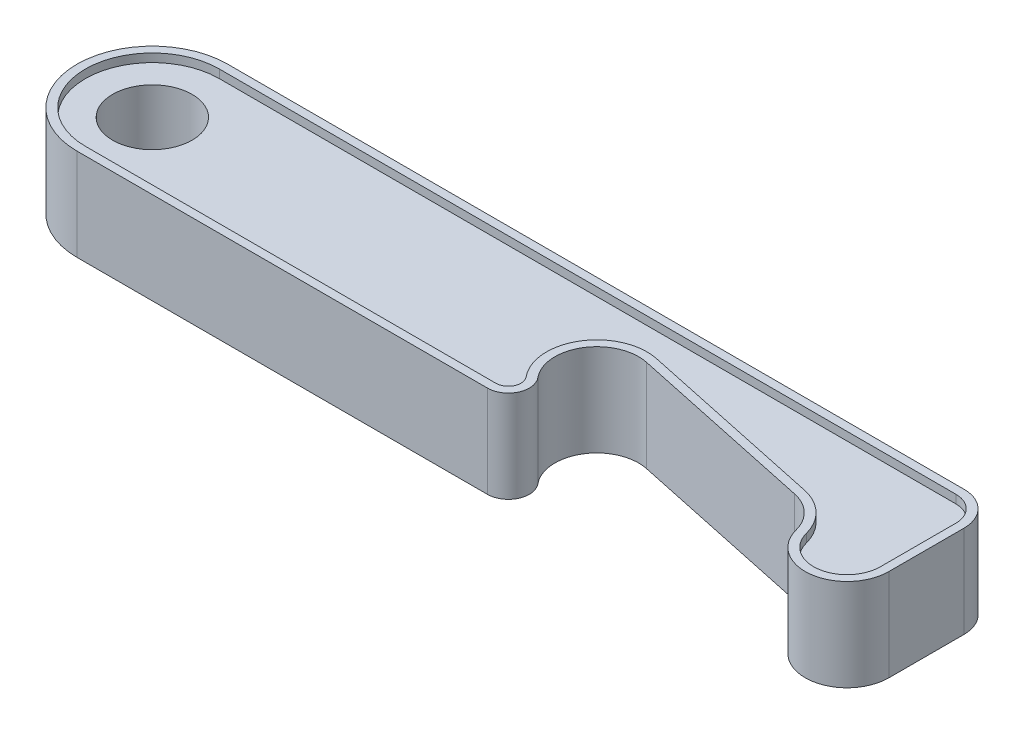
ISO-10303-21;
HEADER;
FILE_DESCRIPTION(('STEP AP214'),'2;1');
FILE_NAME('part.step','',(''),(''),'','','');
FILE_SCHEMA(('AUTOMOTIVE_DESIGN { 1 0 10303 214 1 1 1 1 }'));
ENDSEC;
DATA;
#1=APPLICATION_CONTEXT('core data for automotive mechanical design processes');
#2=APPLICATION_PROTOCOL_DEFINITION('international standard','automotive_design',2000,#1);
#3=PRODUCT_CONTEXT('',#1,'mechanical');
#4=PRODUCT('Part','Part','',(#3));
#5=PRODUCT_RELATED_PRODUCT_CATEGORY('part','',(#4));
#6=PRODUCT_DEFINITION_FORMATION('','',#4);
#7=PRODUCT_DEFINITION_CONTEXT('part definition',#1,'design');
#8=PRODUCT_DEFINITION('design','',#6,#7);
#9=PRODUCT_DEFINITION_SHAPE('','',#8);
#10=(LENGTH_UNIT() NAMED_UNIT(*) SI_UNIT(.MILLI.,.METRE.));
#11=(NAMED_UNIT(*) PLANE_ANGLE_UNIT() SI_UNIT($,.RADIAN.));
#12=(NAMED_UNIT(*) SI_UNIT($,.STERADIAN.) SOLID_ANGLE_UNIT());
#13=UNCERTAINTY_MEASURE_WITH_UNIT(LENGTH_MEASURE(1.E-05),#10,'distance_accuracy_value','');
#14=(GEOMETRIC_REPRESENTATION_CONTEXT(3) GLOBAL_UNCERTAINTY_ASSIGNED_CONTEXT((#13)) GLOBAL_UNIT_ASSIGNED_CONTEXT((#10,
#11,#12)) REPRESENTATION_CONTEXT('',''));
#15=CARTESIAN_POINT('',(0.,0.,0.));
#16=DIRECTION('',(0.,0.,1.));
#17=DIRECTION('',(1.,0.,0.));
#18=AXIS2_PLACEMENT_3D('',#15,#16,#17);
#19=CARTESIAN_POINT('',(0.,5.5,8.));
#20=DIRECTION('',(0.,0.,-1.));
#21=DIRECTION('',(-1.,0.,0.));
#22=AXIS2_PLACEMENT_3D('',#19,#20,#21);
#23=PLANE('',#22);
#24=DIRECTION('',(0.,-1.,0.));
#25=VECTOR('',#24,1.);
#26=CARTESIAN_POINT('',(0.,5.5,8.));
#27=LINE('',#26,#25);
#28=CARTESIAN_POINT('',(0.,-4.5,8.));
#29=VERTEX_POINT('',#28);
#30=CARTESIAN_POINT('',(0.,-5.5,8.));
#31=VERTEX_POINT('',#30);
#32=EDGE_CURVE('E48',#29,#31,#27,.T.);
#33=ORIENTED_EDGE('',*,*,#32,.F.);
#34=DIRECTION('',(1.,0.,0.));
#35=VECTOR('',#34,1.);
#36=CARTESIAN_POINT('',(0.,-4.5,8.));
#37=LINE('',#36,#35);
#38=CARTESIAN_POINT('',(49.0399082917025,-4.5,8.));
#39=VERTEX_POINT('',#38);
#40=EDGE_CURVE('E283',#29,#39,#37,.T.);
#41=ORIENTED_EDGE('',*,*,#40,.T.);
#42=DIRECTION('',(0.,-1.,0.));
#43=VECTOR('',#42,1.);
#44=CARTESIAN_POINT('',(49.0399082917025,5.5,8.));
#45=LINE('',#44,#43);
#46=CARTESIAN_POINT('',(49.0399082917025,-5.5,8.));
#47=VERTEX_POINT('',#46);
#48=EDGE_CURVE('E418',#39,#47,#45,.T.);
#49=ORIENTED_EDGE('',*,*,#48,.T.);
#50=DIRECTION('',(1.,0.,0.));
#51=VECTOR('',#50,1.);
#52=CARTESIAN_POINT('',(0.,-5.5,8.));
#53=LINE('',#52,#51);
#54=EDGE_CURVE('E388',#31,#47,#53,.T.);
#55=ORIENTED_EDGE('',*,*,#54,.F.);
#56=EDGE_LOOP('',(#33,#41,#49,#55));
#57=FACE_BOUND('',#56,.T.);
#58=ADVANCED_FACE('F39',(#57),#23,.T.);
#59=CARTESIAN_POINT('',(0.,5.5,0.));
#60=DIRECTION('',(0.,-1.,0.));
#61=DIRECTION('',(0.,0.,-1.));
#62=AXIS2_PLACEMENT_3D('',#59,#60,#61);
#63=CYLINDRICAL_SURFACE('',#62,8.);
#64=CARTESIAN_POINT('',(0.,-4.5,0.));
#65=DIRECTION('',(0.,1.,0.));
#66=DIRECTION('',(0.,0.,1.));
#67=AXIS2_PLACEMENT_3D('',#64,#65,#66);
#68=CIRCLE('',#67,8.);
#69=CARTESIAN_POINT('',(0.,-4.5,-8.));
#70=VERTEX_POINT('',#69);
#71=EDGE_CURVE('E281',#29,#70,#68,.F.);
#72=ORIENTED_EDGE('',*,*,#71,.F.);
#73=ORIENTED_EDGE('',*,*,#32,.T.);
#74=CARTESIAN_POINT('',(0.,-5.5,0.));
#75=DIRECTION('',(0.,1.,0.));
#76=DIRECTION('',(0.,0.,1.));
#77=AXIS2_PLACEMENT_3D('',#74,#75,#76);
#78=CIRCLE('',#77,8.);
#79=CARTESIAN_POINT('',(0.,-5.5,-8.));
#80=VERTEX_POINT('',#79);
#81=EDGE_CURVE('E391',#31,#80,#78,.F.);
#82=ORIENTED_EDGE('',*,*,#81,.T.);
#83=DIRECTION('',(0.,-1.,0.));
#84=VECTOR('',#83,1.);
#85=CARTESIAN_POINT('',(0.,5.5,-8.));
#86=LINE('',#85,#84);
#87=EDGE_CURVE('E441',#70,#80,#86,.T.);
#88=ORIENTED_EDGE('',*,*,#87,.F.);
#89=EDGE_LOOP('',(#72,#73,#82,#88));
#90=FACE_BOUND('',#89,.T.);
#91=ADVANCED_FACE('F512',(#90),#63,.F.);
#92=CARTESIAN_POINT('',(0.,5.5,-8.));
#93=DIRECTION('',(0.,0.,-1.));
#94=DIRECTION('',(-1.,0.,0.));
#95=AXIS2_PLACEMENT_3D('',#92,#93,#94);
#96=PLANE('',#95);
#97=DIRECTION('',(1.,0.,0.));
#98=VECTOR('',#97,1.);
#99=CARTESIAN_POINT('',(0.,-4.5,-8.));
#100=LINE('',#99,#98);
#101=CARTESIAN_POINT('',(87.9996910570678,-4.5,-8.));
#102=VERTEX_POINT('',#101);
#103=EDGE_CURVE('E302',#70,#102,#100,.T.);
#104=ORIENTED_EDGE('',*,*,#103,.F.);
#105=ORIENTED_EDGE('',*,*,#87,.T.);
#106=DIRECTION('',(1.,0.,0.));
#107=VECTOR('',#106,1.);
#108=CARTESIAN_POINT('',(0.,-5.5,-8.));
#109=LINE('',#108,#107);
#110=CARTESIAN_POINT('',(87.9996910570678,-5.5,-8.));
#111=VERTEX_POINT('',#110);
#112=EDGE_CURVE('E394',#80,#111,#109,.T.);
#113=ORIENTED_EDGE('',*,*,#112,.T.);
#114=DIRECTION('',(0.,-1.,0.));
#115=VECTOR('',#114,1.);
#116=CARTESIAN_POINT('',(87.9996910570678,5.5,-8.));
#117=LINE('',#116,#115);
#118=EDGE_CURVE('E437',#102,#111,#117,.T.);
#119=ORIENTED_EDGE('',*,*,#118,.F.);
#120=EDGE_LOOP('',(#104,#105,#113,#119));
#121=FACE_BOUND('',#120,.T.);
#122=ADVANCED_FACE('F508',(#121),#96,.F.);
#123=CARTESIAN_POINT('',(87.9996910570678,5.5,-5.));
#124=DIRECTION('',(0.,-1.,0.));
#125=DIRECTION('',(0.,0.,-1.));
#126=AXIS2_PLACEMENT_3D('',#123,#124,#125);
#127=CYLINDRICAL_SURFACE('',#126,3.00000000000001);
#128=DIRECTION('',(0.,-1.,0.));
#129=VECTOR('',#128,1.);
#130=CARTESIAN_POINT('',(90.9996910570678,5.5,-5.));
#131=LINE('',#130,#129);
#132=CARTESIAN_POINT('',(90.9996910570678,-4.5,-5.));
#133=VERTEX_POINT('',#132);
#134=CARTESIAN_POINT('',(90.9996910570678,-5.5,-5.));
#135=VERTEX_POINT('',#134);
#136=EDGE_CURVE('E433',#133,#135,#131,.T.);
#137=ORIENTED_EDGE('',*,*,#136,.F.);
#138=CARTESIAN_POINT('',(87.9996910570678,-4.5,-5.));
#139=DIRECTION('',(0.,1.,0.));
#140=DIRECTION('',(0.,0.,1.));
#141=AXIS2_PLACEMENT_3D('',#138,#139,#140);
#142=CIRCLE('',#141,3.00000000000001);
#143=EDGE_CURVE('E299',#133,#102,#142,.T.);
#144=ORIENTED_EDGE('',*,*,#143,.T.);
#145=ORIENTED_EDGE('',*,*,#118,.T.);
#146=CARTESIAN_POINT('',(87.9996910570678,-5.5,-5.));
#147=DIRECTION('',(0.,1.,0.));
#148=DIRECTION('',(0.,0.,1.));
#149=AXIS2_PLACEMENT_3D('',#146,#147,#148);
#150=CIRCLE('',#149,3.00000000000001);
#151=EDGE_CURVE('E397',#135,#111,#150,.T.);
#152=ORIENTED_EDGE('',*,*,#151,.F.);
#153=EDGE_LOOP('',(#137,#144,#145,#152));
#154=FACE_BOUND('',#153,.T.);
#155=ADVANCED_FACE('F504',(#154),#127,.F.);
#156=CARTESIAN_POINT('',(90.9996910570678,5.5,1.40319378118517E-13));
#157=DIRECTION('',(1.,0.,0.));
#158=DIRECTION('',(0.,0.,-1.));
#159=AXIS2_PLACEMENT_3D('',#156,#157,#158);
#160=PLANE('',#159);
#161=DIRECTION('',(0.,0.,1.));
#162=VECTOR('',#161,1.);
#163=CARTESIAN_POINT('',(90.9996910570678,-4.5,1.40319378118517E-13));
#164=LINE('',#163,#162);
#165=CARTESIAN_POINT('',(90.9996910570678,-4.5,4.));
#166=VERTEX_POINT('',#165);
#167=EDGE_CURVE('E297',#133,#166,#164,.T.);
#168=ORIENTED_EDGE('',*,*,#167,.F.);
#169=ORIENTED_EDGE('',*,*,#136,.T.);
#170=DIRECTION('',(0.,0.,1.));
#171=VECTOR('',#170,1.);
#172=CARTESIAN_POINT('',(90.9996910570678,-5.5,1.40319378118517E-13));
#173=LINE('',#172,#171);
#174=CARTESIAN_POINT('',(90.9996910570678,-5.5,4.));
#175=VERTEX_POINT('',#174);
#176=EDGE_CURVE('E400',#135,#175,#173,.T.);
#177=ORIENTED_EDGE('',*,*,#176,.T.);
#178=DIRECTION('',(0.,-1.,0.));
#179=VECTOR('',#178,1.);
#180=CARTESIAN_POINT('',(90.9996910570678,5.5,4.));
#181=LINE('',#180,#179);
#182=EDGE_CURVE('E429',#166,#175,#181,.T.);
#183=ORIENTED_EDGE('',*,*,#182,.F.);
#184=EDGE_LOOP('',(#168,#169,#177,#183));
#185=FACE_BOUND('',#184,.T.);
#186=ADVANCED_FACE('F500',(#185),#160,.F.);
#187=CARTESIAN_POINT('',(86.9996910570678,5.5,4.));
#188=DIRECTION('',(0.,-1.,0.));
#189=DIRECTION('',(0.,0.,-1.));
#190=AXIS2_PLACEMENT_3D('',#187,#188,#189);
#191=CYLINDRICAL_SURFACE('',#190,4.);
#192=CARTESIAN_POINT('',(86.9996910570678,-4.5,4.));
#193=DIRECTION('',(0.,1.,0.));
#194=DIRECTION('',(0.,0.,1.));
#195=AXIS2_PLACEMENT_3D('',#192,#193,#194);
#196=CIRCLE('',#195,4.);
#197=CARTESIAN_POINT('',(83.1267077108604,-4.5,5.00000000000013));
#198=VERTEX_POINT('',#197);
#199=EDGE_CURVE('E295',#166,#198,#196,.F.);
#200=ORIENTED_EDGE('',*,*,#199,.F.);
#201=ORIENTED_EDGE('',*,*,#182,.T.);
#202=CARTESIAN_POINT('',(86.9996910570678,-5.5,4.));
#203=DIRECTION('',(0.,1.,0.));
#204=DIRECTION('',(0.,0.,1.));
#205=AXIS2_PLACEMENT_3D('',#202,#203,#204);
#206=CIRCLE('',#205,4.);
#207=CARTESIAN_POINT('',(83.1267077108604,-5.5,5.00000000000013));
#208=VERTEX_POINT('',#207);
#209=EDGE_CURVE('E403',#175,#208,#206,.F.);
#210=ORIENTED_EDGE('',*,*,#209,.T.);
#211=DIRECTION('',(0.,-1.,0.));
#212=VECTOR('',#211,1.);
#213=CARTESIAN_POINT('',(83.1267077108604,5.5,5.00000000000013));
#214=LINE('',#213,#212);
#215=EDGE_CURVE('E425',#198,#208,#214,.T.);
#216=ORIENTED_EDGE('',*,*,#215,.F.);
#217=EDGE_LOOP('',(#200,#201,#210,#216));
#218=FACE_BOUND('',#217,.T.);
#219=ADVANCED_FACE('F496',(#218),#191,.F.);
#220=CARTESIAN_POINT('',(77.3172326915498,5.5,6.50000000000018));
#221=DIRECTION('',(0.,-1.,0.));
#222=DIRECTION('',(0.,0.,-1.));
#223=AXIS2_PLACEMENT_3D('',#220,#221,#222);
#224=CYLINDRICAL_SURFACE('',#223,5.99999999999948);
#225=CARTESIAN_POINT('',(77.3172326915498,-4.5,6.50000000000018));
#226=DIRECTION('',(0.,1.,0.));
#227=DIRECTION('',(0.,0.,1.));
#228=AXIS2_PLACEMENT_3D('',#225,#226,#227);
#229=CIRCLE('',#228,5.99999999999948);
#230=CARTESIAN_POINT('',(78.5647028364565,-4.5,0.631114395597909));
#231=VERTEX_POINT('',#230);
#232=EDGE_CURVE('E293',#198,#231,#229,.T.);
#233=ORIENTED_EDGE('',*,*,#232,.F.);
#234=ORIENTED_EDGE('',*,*,#215,.T.);
#235=CARTESIAN_POINT('',(77.3172326915498,-5.5,6.50000000000018));
#236=DIRECTION('',(0.,1.,0.));
#237=DIRECTION('',(0.,0.,1.));
#238=AXIS2_PLACEMENT_3D('',#235,#236,#237);
#239=CIRCLE('',#238,5.99999999999948);
#240=CARTESIAN_POINT('',(78.5647028364565,-5.5,0.631114395597909));
#241=VERTEX_POINT('',#240);
#242=EDGE_CURVE('E406',#208,#241,#239,.T.);
#243=ORIENTED_EDGE('',*,*,#242,.T.);
#244=DIRECTION('',(0.,-1.,0.));
#245=VECTOR('',#244,1.);
#246=CARTESIAN_POINT('',(78.5647028364565,5.5,0.631114395597909));
#247=LINE('',#246,#245);
#248=EDGE_CURVE('E421',#231,#241,#247,.T.);
#249=ORIENTED_EDGE('',*,*,#248,.F.);
#250=EDGE_LOOP('',(#233,#234,#243,#249));
#251=FACE_BOUND('',#250,.T.);
#252=ADVANCED_FACE('F490',(#251),#224,.T.);
#253=CARTESIAN_POINT('',(3.26778903925557,5.5,-15.3737387055024));
#254=DIRECTION('',(-0.207911690817799,0.,0.978147600733797));
#255=DIRECTION('',(0.978147600733797,0.,0.207911690817799));
#256=AXIS2_PLACEMENT_3D('',#253,#254,#255);
#257=PLANE('',#256);
#258=DIRECTION('',(-0.978147600733797,0.,-0.207911690817799));
#259=VECTOR('',#258,1.);
#260=CARTESIAN_POINT('',(3.26778903925557,-4.5,-15.3737387055024));
#261=LINE('',#260,#259);
#262=CARTESIAN_POINT('',(56.0647028364566,-4.5,-4.15140824197852));
#263=VERTEX_POINT('',#262);
#264=EDGE_CURVE('E291',#231,#263,#261,.T.);
#265=ORIENTED_EDGE('',*,*,#264,.F.);
#266=ORIENTED_EDGE('',*,*,#248,.T.);
#267=DIRECTION('',(-0.978147600733797,0.,-0.207911690817799));
#268=VECTOR('',#267,1.);
#269=CARTESIAN_POINT('',(3.26778903925557,-5.5,-15.3737387055024));
#270=LINE('',#269,#268);
#271=CARTESIAN_POINT('',(56.0647028364566,-5.5,-4.15140824197852));
#272=VERTEX_POINT('',#271);
#273=EDGE_CURVE('E409',#241,#272,#270,.T.);
#274=ORIENTED_EDGE('',*,*,#273,.T.);
#275=DIRECTION('',(0.,-1.,0.));
#276=VECTOR('',#275,1.);
#277=CARTESIAN_POINT('',(56.0647028364566,5.5,-4.15140824197852));
#278=LINE('',#277,#276);
#279=EDGE_CURVE('E247',#263,#272,#278,.T.);
#280=ORIENTED_EDGE('',*,*,#279,.F.);
#281=EDGE_LOOP('',(#265,#266,#274,#280));
#282=FACE_BOUND('',#281,.T.);
#283=ADVANCED_FACE('F486',(#282),#257,.F.);
#284=CARTESIAN_POINT('',(54.8172326915498,5.5,1.71747736242426));
#285=DIRECTION('',(0.,-1.,0.));
#286=DIRECTION('',(0.,0.,-1.));
#287=AXIS2_PLACEMENT_3D('',#284,#285,#286);
#288=CYLINDRICAL_SURFACE('',#287,5.99999999999999);
#289=CARTESIAN_POINT('',(54.8172326915498,-4.5,1.71747736242426));
#290=DIRECTION('',(0.,1.,0.));
#291=DIRECTION('',(0.,0.,1.));
#292=AXIS2_PLACEMENT_3D('',#289,#290,#291);
#293=CIRCLE('',#292,5.99999999999999);
#294=CARTESIAN_POINT('',(50.1953731716718,-4.5,5.54349547248508));
#295=VERTEX_POINT('',#294);
#296=EDGE_CURVE('E289',#263,#295,#293,.T.);
#297=ORIENTED_EDGE('',*,*,#296,.F.);
#298=ORIENTED_EDGE('',*,*,#279,.T.);
#299=CARTESIAN_POINT('',(54.8172326915498,-5.5,1.71747736242426));
#300=DIRECTION('',(0.,1.,0.));
#301=DIRECTION('',(0.,0.,1.));
#302=AXIS2_PLACEMENT_3D('',#299,#300,#301);
#303=CIRCLE('',#302,5.99999999999999);
#304=CARTESIAN_POINT('',(50.1953731716718,-5.5,5.54349547248508));
#305=VERTEX_POINT('',#304);
#306=EDGE_CURVE('E412',#272,#305,#303,.T.);
#307=ORIENTED_EDGE('',*,*,#306,.T.);
#308=DIRECTION('',(0.,-1.,0.));
#309=VECTOR('',#308,1.);
#310=CARTESIAN_POINT('',(50.1953731716718,5.5,5.54349547248508));
#311=LINE('',#310,#309);
#312=EDGE_CURVE('E248',#295,#305,#311,.T.);
#313=ORIENTED_EDGE('',*,*,#312,.F.);
#314=EDGE_LOOP('',(#297,#298,#307,#313));
#315=FACE_BOUND('',#314,.T.);
#316=ADVANCED_FACE('F480',(#315),#288,.T.);
#317=CARTESIAN_POINT('',(49.0399082917025,5.5,6.50000000000018));
#318=DIRECTION('',(0.,-1.,0.));
#319=DIRECTION('',(0.,0.,-1.));
#320=AXIS2_PLACEMENT_3D('',#317,#318,#319);
#321=CYLINDRICAL_SURFACE('',#320,1.49999999999982);
#322=ORIENTED_EDGE('',*,*,#48,.F.);
#323=CARTESIAN_POINT('',(49.0399082917025,-4.5,6.50000000000018));
#324=DIRECTION('',(0.,1.,0.));
#325=DIRECTION('',(0.,0.,1.));
#326=AXIS2_PLACEMENT_3D('',#323,#324,#325);
#327=CIRCLE('',#326,1.49999999999982);
#328=EDGE_CURVE('E286',#39,#295,#327,.T.);
#329=ORIENTED_EDGE('',*,*,#328,.T.);
#330=ORIENTED_EDGE('',*,*,#312,.T.);
#331=CARTESIAN_POINT('',(49.0399082917025,-5.5,6.50000000000018));
#332=DIRECTION('',(0.,1.,0.));
#333=DIRECTION('',(0.,0.,1.));
#334=AXIS2_PLACEMENT_3D('',#331,#332,#333);
#335=CIRCLE('',#334,1.49999999999982);
#336=EDGE_CURVE('E309',#47,#305,#335,.T.);
#337=ORIENTED_EDGE('',*,*,#336,.F.);
#338=EDGE_LOOP('',(#322,#329,#330,#337));
#339=FACE_BOUND('',#338,.T.);
#340=ADVANCED_FACE('F476',(#339),#321,.F.);
#341=DIRECTION('',(1.,0.,0.));
#342=VECTOR('',#341,1.);
#343=CARTESIAN_POINT('',(0.,4.5,8.));
#344=LINE('',#343,#342);
#345=CARTESIAN_POINT('',(0.,4.5,8.));
#346=VERTEX_POINT('',#345);
#347=CARTESIAN_POINT('',(49.0399082917025,4.5,8.));
#348=VERTEX_POINT('',#347);
#349=EDGE_CURVE('E56',#346,#348,#344,.T.);
#350=ORIENTED_EDGE('',*,*,#349,.F.);
#351=CARTESIAN_POINT('',(0.,5.5,8.));
#352=VERTEX_POINT('',#351);
#353=EDGE_CURVE('E11',#352,#346,#27,.T.);
#354=ORIENTED_EDGE('',*,*,#353,.F.);
#355=DIRECTION('',(1.,0.,0.));
#356=VECTOR('',#355,1.);
#357=CARTESIAN_POINT('',(0.,5.5,8.));
#358=LINE('',#357,#356);
#359=CARTESIAN_POINT('',(49.0399082917025,5.5,8.));
#360=VERTEX_POINT('',#359);
#361=EDGE_CURVE('E333',#352,#360,#358,.T.);
#362=ORIENTED_EDGE('',*,*,#361,.T.);
#363=EDGE_CURVE('E417',#360,#348,#45,.T.);
#364=ORIENTED_EDGE('',*,*,#363,.T.);
#365=EDGE_LOOP('',(#350,#354,#362,#364));
#366=FACE_BOUND('',#365,.T.);
#367=ADVANCED_FACE('F527',(#366),#23,.T.);
#368=ORIENTED_EDGE('',*,*,#353,.T.);
#369=CARTESIAN_POINT('',(0.,4.5,0.));
#370=DIRECTION('',(0.,1.,0.));
#371=DIRECTION('',(0.,0.,1.));
#372=AXIS2_PLACEMENT_3D('',#369,#370,#371);
#373=CIRCLE('',#372,8.);
#374=CARTESIAN_POINT('',(0.,4.5,-8.));
#375=VERTEX_POINT('',#374);
#376=EDGE_CURVE('E62',#346,#375,#373,.F.);
#377=ORIENTED_EDGE('',*,*,#376,.T.);
#378=CARTESIAN_POINT('',(0.,5.5,-8.));
#379=VERTEX_POINT('',#378);
#380=EDGE_CURVE('E442',#379,#375,#86,.T.);
#381=ORIENTED_EDGE('',*,*,#380,.F.);
#382=CARTESIAN_POINT('',(0.,5.5,0.));
#383=DIRECTION('',(0.,1.,0.));
#384=DIRECTION('',(0.,0.,1.));
#385=AXIS2_PLACEMENT_3D('',#382,#383,#384);
#386=CIRCLE('',#385,8.);
#387=EDGE_CURVE('E336',#352,#379,#386,.F.);
#388=ORIENTED_EDGE('',*,*,#387,.F.);
#389=EDGE_LOOP('',(#368,#377,#381,#388));
#390=FACE_BOUND('',#389,.T.);
#391=ADVANCED_FACE('F532',(#390),#63,.F.);
#392=ORIENTED_EDGE('',*,*,#380,.T.);
#393=DIRECTION('',(1.,0.,0.));
#394=VECTOR('',#393,1.);
#395=CARTESIAN_POINT('',(0.,4.5,-8.));
#396=LINE('',#395,#394);
#397=CARTESIAN_POINT('',(87.9996910570678,4.5,-8.));
#398=VERTEX_POINT('',#397);
#399=EDGE_CURVE('E275',#375,#398,#396,.T.);
#400=ORIENTED_EDGE('',*,*,#399,.T.);
#401=CARTESIAN_POINT('',(87.9996910570678,5.5,-8.));
#402=VERTEX_POINT('',#401);
#403=EDGE_CURVE('E438',#402,#398,#117,.T.);
#404=ORIENTED_EDGE('',*,*,#403,.F.);
#405=DIRECTION('',(1.,0.,0.));
#406=VECTOR('',#405,1.);
#407=CARTESIAN_POINT('',(0.,5.5,-8.));
#408=LINE('',#407,#406);
#409=EDGE_CURVE('E339',#379,#402,#408,.T.);
#410=ORIENTED_EDGE('',*,*,#409,.F.);
#411=EDGE_LOOP('',(#392,#400,#404,#410));
#412=FACE_BOUND('',#411,.T.);
#413=ADVANCED_FACE('F539',(#412),#96,.F.);
#414=CARTESIAN_POINT('',(87.9996910570678,4.5,-5.));
#415=DIRECTION('',(0.,1.,0.));
#416=DIRECTION('',(0.,0.,1.));
#417=AXIS2_PLACEMENT_3D('',#414,#415,#416);
#418=CIRCLE('',#417,3.00000000000001);
#419=CARTESIAN_POINT('',(90.9996910570678,4.5,-5.));
#420=VERTEX_POINT('',#419);
#421=EDGE_CURVE('E272',#420,#398,#418,.T.);
#422=ORIENTED_EDGE('',*,*,#421,.F.);
#423=CARTESIAN_POINT('',(90.9996910570678,5.5,-5.));
#424=VERTEX_POINT('',#423);
#425=EDGE_CURVE('E434',#424,#420,#131,.T.);
#426=ORIENTED_EDGE('',*,*,#425,.F.);
#427=CARTESIAN_POINT('',(87.9996910570678,5.5,-5.));
#428=DIRECTION('',(0.,1.,0.));
#429=DIRECTION('',(0.,0.,1.));
#430=AXIS2_PLACEMENT_3D('',#427,#428,#429);
#431=CIRCLE('',#430,3.00000000000001);
#432=EDGE_CURVE('E341',#424,#402,#431,.T.);
#433=ORIENTED_EDGE('',*,*,#432,.T.);
#434=ORIENTED_EDGE('',*,*,#403,.T.);
#435=EDGE_LOOP('',(#422,#426,#433,#434));
#436=FACE_BOUND('',#435,.T.);
#437=ADVANCED_FACE('F621',(#436),#127,.F.);
#438=ORIENTED_EDGE('',*,*,#425,.T.);
#439=DIRECTION('',(0.,0.,1.));
#440=VECTOR('',#439,1.);
#441=CARTESIAN_POINT('',(90.9996910570678,4.5,1.40319378118517E-13));
#442=LINE('',#441,#440);
#443=CARTESIAN_POINT('',(90.9996910570678,4.5,4.));
#444=VERTEX_POINT('',#443);
#445=EDGE_CURVE('E270',#420,#444,#442,.T.);
#446=ORIENTED_EDGE('',*,*,#445,.T.);
#447=CARTESIAN_POINT('',(90.9996910570678,5.5,4.));
#448=VERTEX_POINT('',#447);
#449=EDGE_CURVE('E430',#448,#444,#181,.T.);
#450=ORIENTED_EDGE('',*,*,#449,.F.);
#451=DIRECTION('',(0.,0.,1.));
#452=VECTOR('',#451,1.);
#453=CARTESIAN_POINT('',(90.9996910570678,5.5,1.40319378118517E-13));
#454=LINE('',#453,#452);
#455=EDGE_CURVE('E344',#424,#448,#454,.T.);
#456=ORIENTED_EDGE('',*,*,#455,.F.);
#457=EDGE_LOOP('',(#438,#446,#450,#456));
#458=FACE_BOUND('',#457,.T.);
#459=ADVANCED_FACE('F624',(#458),#160,.F.);
#460=ORIENTED_EDGE('',*,*,#449,.T.);
#461=CARTESIAN_POINT('',(86.9996910570678,4.5,4.));
#462=DIRECTION('',(0.,1.,0.));
#463=DIRECTION('',(0.,0.,1.));
#464=AXIS2_PLACEMENT_3D('',#461,#462,#463);
#465=CIRCLE('',#464,4.);
#466=CARTESIAN_POINT('',(83.1267077108604,4.5,5.00000000000013));
#467=VERTEX_POINT('',#466);
#468=EDGE_CURVE('E268',#444,#467,#465,.F.);
#469=ORIENTED_EDGE('',*,*,#468,.T.);
#470=CARTESIAN_POINT('',(83.1267077108604,5.5,5.00000000000013));
#471=VERTEX_POINT('',#470);
#472=EDGE_CURVE('E426',#471,#467,#214,.T.);
#473=ORIENTED_EDGE('',*,*,#472,.F.);
#474=CARTESIAN_POINT('',(86.9996910570678,5.5,4.));
#475=DIRECTION('',(0.,1.,0.));
#476=DIRECTION('',(0.,0.,1.));
#477=AXIS2_PLACEMENT_3D('',#474,#475,#476);
#478=CIRCLE('',#477,4.);
#479=EDGE_CURVE('E347',#448,#471,#478,.F.);
#480=ORIENTED_EDGE('',*,*,#479,.F.);
#481=EDGE_LOOP('',(#460,#469,#473,#480));
#482=FACE_BOUND('',#481,.T.);
#483=ADVANCED_FACE('F630',(#482),#191,.F.);
#484=ORIENTED_EDGE('',*,*,#472,.T.);
#485=CARTESIAN_POINT('',(77.3172326915498,4.5,6.50000000000018));
#486=DIRECTION('',(0.,1.,0.));
#487=DIRECTION('',(0.,0.,1.));
#488=AXIS2_PLACEMENT_3D('',#485,#486,#487);
#489=CIRCLE('',#488,5.99999999999948);
#490=CARTESIAN_POINT('',(78.5647028364565,4.5,0.631114395597909));
#491=VERTEX_POINT('',#490);
#492=EDGE_CURVE('E266',#467,#491,#489,.T.);
#493=ORIENTED_EDGE('',*,*,#492,.T.);
#494=CARTESIAN_POINT('',(78.5647028364565,5.5,0.631114395597909));
#495=VERTEX_POINT('',#494);
#496=EDGE_CURVE('E422',#495,#491,#247,.T.);
#497=ORIENTED_EDGE('',*,*,#496,.F.);
#498=CARTESIAN_POINT('',(77.3172326915498,5.5,6.50000000000018));
#499=DIRECTION('',(0.,1.,0.));
#500=DIRECTION('',(0.,0.,1.));
#501=AXIS2_PLACEMENT_3D('',#498,#499,#500);
#502=CIRCLE('',#501,5.99999999999948);
#503=EDGE_CURVE('E350',#471,#495,#502,.T.);
#504=ORIENTED_EDGE('',*,*,#503,.F.);
#505=EDGE_LOOP('',(#484,#493,#497,#504));
#506=FACE_BOUND('',#505,.T.);
#507=ADVANCED_FACE('F633',(#506),#224,.T.);
#508=ORIENTED_EDGE('',*,*,#496,.T.);
#509=DIRECTION('',(-0.978147600733797,0.,-0.207911690817799));
#510=VECTOR('',#509,1.);
#511=CARTESIAN_POINT('',(3.26778903925557,4.5,-15.3737387055024));
#512=LINE('',#511,#510);
#513=CARTESIAN_POINT('',(56.0647028364566,4.5,-4.15140824197852));
#514=VERTEX_POINT('',#513);
#515=EDGE_CURVE('E258',#491,#514,#512,.T.);
#516=ORIENTED_EDGE('',*,*,#515,.T.);
#517=CARTESIAN_POINT('',(56.0647028364566,5.5,-4.15140824197852));
#518=VERTEX_POINT('',#517);
#519=EDGE_CURVE('E255',#518,#514,#278,.T.);
#520=ORIENTED_EDGE('',*,*,#519,.F.);
#521=DIRECTION('',(-0.978147600733797,0.,-0.207911690817799));
#522=VECTOR('',#521,1.);
#523=CARTESIAN_POINT('',(3.26778903925557,5.5,-15.3737387055024));
#524=LINE('',#523,#522);
#525=EDGE_CURVE('E353',#495,#518,#524,.T.);
#526=ORIENTED_EDGE('',*,*,#525,.F.);
#527=EDGE_LOOP('',(#508,#516,#520,#526));
#528=FACE_BOUND('',#527,.T.);
#529=ADVANCED_FACE('F635',(#528),#257,.F.);
#530=ORIENTED_EDGE('',*,*,#519,.T.);
#531=CARTESIAN_POINT('',(54.8172326915498,4.5,1.71747736242426));
#532=DIRECTION('',(0.,1.,0.));
#533=DIRECTION('',(0.,0.,1.));
#534=AXIS2_PLACEMENT_3D('',#531,#532,#533);
#535=CIRCLE('',#534,5.99999999999999);
#536=CARTESIAN_POINT('',(50.1953731716718,4.5,5.54349547248508));
#537=VERTEX_POINT('',#536);
#538=EDGE_CURVE('E252',#514,#537,#535,.T.);
#539=ORIENTED_EDGE('',*,*,#538,.T.);
#540=CARTESIAN_POINT('',(50.1953731716718,5.5,5.54349547248508));
#541=VERTEX_POINT('',#540);
#542=EDGE_CURVE('E239',#541,#537,#311,.T.);
#543=ORIENTED_EDGE('',*,*,#542,.F.);
#544=CARTESIAN_POINT('',(54.8172326915498,5.5,1.71747736242426));
#545=DIRECTION('',(0.,1.,0.));
#546=DIRECTION('',(0.,0.,1.));
#547=AXIS2_PLACEMENT_3D('',#544,#545,#546);
#548=CIRCLE('',#547,5.99999999999999);
#549=EDGE_CURVE('E356',#518,#541,#548,.T.);
#550=ORIENTED_EDGE('',*,*,#549,.F.);
#551=EDGE_LOOP('',(#530,#539,#543,#550));
#552=FACE_BOUND('',#551,.T.);
#553=ADVANCED_FACE('F253',(#552),#288,.T.);
#554=CARTESIAN_POINT('',(77.3172326915498,5.5,6.50000000000018));
#555=DIRECTION('',(0.,-1.,0.));
#556=DIRECTION('',(0.,0.,-1.));
#557=AXIS2_PLACEMENT_3D('',#554,#555,#556);
#558=CYLINDRICAL_SURFACE('',#557,4.99999999999948);
#559=CARTESIAN_POINT('',(77.3172326915498,-5.5,6.50000000000018));
#560=DIRECTION('',(0.,1.,0.));
#561=DIRECTION('',(0.,0.,1.));
#562=AXIS2_PLACEMENT_3D('',#559,#560,#561);
#563=CIRCLE('',#562,4.99999999999948);
#564=CARTESIAN_POINT('',(82.1584618743085,-5.5,5.25000000000016));
#565=VERTEX_POINT('',#564);
#566=CARTESIAN_POINT('',(78.3567911456387,-5.5,1.60926199633171));
#567=VERTEX_POINT('',#566);
#568=EDGE_CURVE('E277',#565,#567,#563,.T.);
#569=ORIENTED_EDGE('',*,*,#568,.F.);
#570=DIRECTION('',(0.,-1.,0.));
#571=VECTOR('',#570,1.);
#572=CARTESIAN_POINT('',(82.1584618743085,5.5,5.25000000000016));
#573=LINE('',#572,#571);
#574=CARTESIAN_POINT('',(82.1584618743085,5.5,5.25000000000016));
#575=VERTEX_POINT('',#574);
#576=EDGE_CURVE('E43',#575,#565,#573,.T.);
#577=ORIENTED_EDGE('',*,*,#576,.F.);
#578=CARTESIAN_POINT('',(77.3172326915498,5.5,6.50000000000018));
#579=DIRECTION('',(0.,1.,0.));
#580=DIRECTION('',(0.,0.,1.));
#581=AXIS2_PLACEMENT_3D('',#578,#579,#580);
#582=CIRCLE('',#581,4.99999999999948);
#583=CARTESIAN_POINT('',(78.3567911456387,5.5,1.60926199633171));
#584=VERTEX_POINT('',#583);
#585=EDGE_CURVE('E305',#575,#584,#582,.T.);
#586=ORIENTED_EDGE('',*,*,#585,.T.);
#587=DIRECTION('',(0.,-1.,0.));
#588=VECTOR('',#587,1.);
#589=CARTESIAN_POINT('',(78.3567911456387,5.5,1.60926199633171));
#590=LINE('',#589,#588);
#591=EDGE_CURVE('E359',#584,#567,#590,.T.);
#592=ORIENTED_EDGE('',*,*,#591,.T.);
#593=EDGE_LOOP('',(#569,#577,#586,#592));
#594=FACE_BOUND('',#593,.T.);
#595=ADVANCED_FACE('F41',(#594),#558,.F.);
#596=CARTESIAN_POINT('',(86.9996910570678,5.5,4.));
#597=DIRECTION('',(0.,-1.,0.));
#598=DIRECTION('',(0.,0.,-1.));
#599=AXIS2_PLACEMENT_3D('',#596,#597,#598);
#600=CYLINDRICAL_SURFACE('',#599,5.00000000000001);
#601=CARTESIAN_POINT('',(86.9996910570678,-5.5,4.));
#602=DIRECTION('',(0.,1.,0.));
#603=DIRECTION('',(0.,0.,1.));
#604=AXIS2_PLACEMENT_3D('',#601,#602,#603);
#605=CIRCLE('',#604,5.00000000000001);
#606=CARTESIAN_POINT('',(91.9996910570678,-5.5,4.));
#607=VERTEX_POINT('',#606);
#608=EDGE_CURVE('E362',#607,#565,#605,.F.);
#609=ORIENTED_EDGE('',*,*,#608,.F.);
#610=DIRECTION('',(0.,-1.,0.));
#611=VECTOR('',#610,1.);
#612=CARTESIAN_POINT('',(91.9996910570678,5.5,4.));
#613=LINE('',#612,#611);
#614=CARTESIAN_POINT('',(91.9996910570678,5.5,4.));
#615=VERTEX_POINT('',#614);
#616=EDGE_CURVE('E459',#615,#607,#613,.T.);
#617=ORIENTED_EDGE('',*,*,#616,.F.);
#618=CARTESIAN_POINT('',(86.9996910570678,5.5,4.));
#619=DIRECTION('',(0.,1.,0.));
#620=DIRECTION('',(0.,0.,1.));
#621=AXIS2_PLACEMENT_3D('',#618,#619,#620);
#622=CIRCLE('',#621,5.00000000000001);
#623=EDGE_CURVE('E308',#615,#575,#622,.F.);
#624=ORIENTED_EDGE('',*,*,#623,.T.);
#625=ORIENTED_EDGE('',*,*,#576,.T.);
#626=EDGE_LOOP('',(#609,#617,#624,#625));
#627=FACE_BOUND('',#626,.T.);
#628=ADVANCED_FACE('F586',(#627),#600,.T.);
#629=CARTESIAN_POINT('',(91.9996910570678,5.5,-1.41861354541608E-13));
#630=DIRECTION('',(1.,0.,0.));
#631=DIRECTION('',(0.,0.,-1.));
#632=AXIS2_PLACEMENT_3D('',#629,#630,#631);
#633=PLANE('',#632);
#634=DIRECTION('',(0.,0.,1.));
#635=VECTOR('',#634,1.);
#636=CARTESIAN_POINT('',(91.9996910570678,-5.5,-1.41861354541608E-13));
#637=LINE('',#636,#635);
#638=CARTESIAN_POINT('',(91.9996910570678,-5.5,-5.));
#639=VERTEX_POINT('',#638);
#640=EDGE_CURVE('E365',#639,#607,#637,.T.);
#641=ORIENTED_EDGE('',*,*,#640,.F.);
#642=DIRECTION('',(0.,-1.,0.));
#643=VECTOR('',#642,1.);
#644=CARTESIAN_POINT('',(91.9996910570678,5.5,-5.));
#645=LINE('',#644,#643);
#646=CARTESIAN_POINT('',(91.9996910570678,5.5,-5.));
#647=VERTEX_POINT('',#646);
#648=EDGE_CURVE('E458',#647,#639,#645,.T.);
#649=ORIENTED_EDGE('',*,*,#648,.F.);
#650=DIRECTION('',(0.,0.,1.));
#651=VECTOR('',#650,1.);
#652=CARTESIAN_POINT('',(91.9996910570678,5.5,-1.41861354541608E-13));
#653=LINE('',#652,#651);
#654=EDGE_CURVE('E312',#647,#615,#653,.T.);
#655=ORIENTED_EDGE('',*,*,#654,.T.);
#656=ORIENTED_EDGE('',*,*,#616,.T.);
#657=EDGE_LOOP('',(#641,#649,#655,#656));
#658=FACE_BOUND('',#657,.T.);
#659=ADVANCED_FACE('F583',(#658),#633,.T.);
#660=CARTESIAN_POINT('',(87.9996910570678,5.5,-5.));
#661=DIRECTION('',(0.,-1.,0.));
#662=DIRECTION('',(0.,0.,-1.));
#663=AXIS2_PLACEMENT_3D('',#660,#661,#662);
#664=CYLINDRICAL_SURFACE('',#663,4.);
#665=CARTESIAN_POINT('',(87.9996910570678,-5.5,-5.));
#666=DIRECTION('',(0.,1.,0.));
#667=DIRECTION('',(0.,0.,1.));
#668=AXIS2_PLACEMENT_3D('',#665,#666,#667);
#669=CIRCLE('',#668,4.);
#670=CARTESIAN_POINT('',(87.9996910570678,-5.5,-9.));
#671=VERTEX_POINT('',#670);
#672=EDGE_CURVE('E368',#639,#671,#669,.T.);
#673=ORIENTED_EDGE('',*,*,#672,.T.);
#674=DIRECTION('',(0.,-1.,0.));
#675=VECTOR('',#674,1.);
#676=CARTESIAN_POINT('',(87.9996910570678,5.5,-9.));
#677=LINE('',#676,#675);
#678=CARTESIAN_POINT('',(87.9996910570678,5.5,-9.));
#679=VERTEX_POINT('',#678);
#680=EDGE_CURVE('E456',#679,#671,#677,.T.);
#681=ORIENTED_EDGE('',*,*,#680,.F.);
#682=CARTESIAN_POINT('',(87.9996910570678,5.5,-5.));
#683=DIRECTION('',(0.,1.,0.));
#684=DIRECTION('',(0.,0.,1.));
#685=AXIS2_PLACEMENT_3D('',#682,#683,#684);
#686=CIRCLE('',#685,4.);
#687=EDGE_CURVE('E315',#647,#679,#686,.T.);
#688=ORIENTED_EDGE('',*,*,#687,.F.);
#689=ORIENTED_EDGE('',*,*,#648,.T.);
#690=EDGE_LOOP('',(#673,#681,#688,#689));
#691=FACE_BOUND('',#690,.T.);
#692=ADVANCED_FACE('F579',(#691),#664,.T.);
#693=CARTESIAN_POINT('',(0.,5.5,-9.));
#694=DIRECTION('',(0.,0.,-1.));
#695=DIRECTION('',(-1.,0.,0.));
#696=AXIS2_PLACEMENT_3D('',#693,#694,#695);
#697=PLANE('',#696);
#698=DIRECTION('',(1.,0.,0.));
#699=VECTOR('',#698,1.);
#700=CARTESIAN_POINT('',(0.,-5.5,-9.));
#701=LINE('',#700,#699);
#702=CARTESIAN_POINT('',(0.,-5.5,-9.));
#703=VERTEX_POINT('',#702);
#704=EDGE_CURVE('E371',#703,#671,#701,.T.);
#705=ORIENTED_EDGE('',*,*,#704,.F.);
#706=DIRECTION('',(0.,-1.,0.));
#707=VECTOR('',#706,1.);
#708=CARTESIAN_POINT('',(0.,5.5,-9.));
#709=LINE('',#708,#707);
#710=CARTESIAN_POINT('',(0.,5.5,-9.));
#711=VERTEX_POINT('',#710);
#712=EDGE_CURVE('E454',#711,#703,#709,.T.);
#713=ORIENTED_EDGE('',*,*,#712,.F.);
#714=DIRECTION('',(1.,0.,0.));
#715=VECTOR('',#714,1.);
#716=CARTESIAN_POINT('',(0.,5.5,-9.));
#717=LINE('',#716,#715);
#718=EDGE_CURVE('E317',#711,#679,#717,.T.);
#719=ORIENTED_EDGE('',*,*,#718,.T.);
#720=ORIENTED_EDGE('',*,*,#680,.T.);
#721=EDGE_LOOP('',(#705,#713,#719,#720));
#722=FACE_BOUND('',#721,.T.);
#723=ADVANCED_FACE('F575',(#722),#697,.T.);
#724=CARTESIAN_POINT('',(0.,5.5,0.));
#725=DIRECTION('',(0.,-1.,0.));
#726=DIRECTION('',(0.,0.,-1.));
#727=AXIS2_PLACEMENT_3D('',#724,#725,#726);
#728=CYLINDRICAL_SURFACE('',#727,9.);
#729=CARTESIAN_POINT('',(0.,-5.5,0.));
#730=DIRECTION('',(0.,1.,0.));
#731=DIRECTION('',(0.,0.,1.));
#732=AXIS2_PLACEMENT_3D('',#729,#730,#731);
#733=CIRCLE('',#732,9.);
#734=CARTESIAN_POINT('',(0.,-5.5,9.));
#735=VERTEX_POINT('',#734);
#736=EDGE_CURVE('E374',#735,#703,#733,.F.);
#737=ORIENTED_EDGE('',*,*,#736,.F.);
#738=DIRECTION('',(0.,-1.,0.));
#739=VECTOR('',#738,1.);
#740=CARTESIAN_POINT('',(0.,5.5,9.));
#741=LINE('',#740,#739);
#742=CARTESIAN_POINT('',(0.,5.5,9.));
#743=VERTEX_POINT('',#742);
#744=EDGE_CURVE('E452',#743,#735,#741,.T.);
#745=ORIENTED_EDGE('',*,*,#744,.F.);
#746=CARTESIAN_POINT('',(0.,5.5,0.));
#747=DIRECTION('',(0.,1.,0.));
#748=DIRECTION('',(0.,0.,1.));
#749=AXIS2_PLACEMENT_3D('',#746,#747,#748);
#750=CIRCLE('',#749,9.);
#751=EDGE_CURVE('E320',#743,#711,#750,.F.);
#752=ORIENTED_EDGE('',*,*,#751,.T.);
#753=ORIENTED_EDGE('',*,*,#712,.T.);
#754=EDGE_LOOP('',(#737,#745,#752,#753));
#755=FACE_BOUND('',#754,.T.);
#756=ADVANCED_FACE('F571',(#755),#728,.T.);
#757=CARTESIAN_POINT('',(0.,5.5,9.));
#758=DIRECTION('',(0.,0.,-1.));
#759=DIRECTION('',(-1.,0.,0.));
#760=AXIS2_PLACEMENT_3D('',#757,#758,#759);
#761=PLANE('',#760);
#762=DIRECTION('',(1.,0.,0.));
#763=VECTOR('',#762,1.);
#764=CARTESIAN_POINT('',(0.,-5.5,9.));
#765=LINE('',#764,#763);
#766=CARTESIAN_POINT('',(49.0399082917025,-5.5,9.));
#767=VERTEX_POINT('',#766);
#768=EDGE_CURVE('E377',#735,#767,#765,.T.);
#769=ORIENTED_EDGE('',*,*,#768,.T.);
#770=DIRECTION('',(0.,-1.,0.));
#771=VECTOR('',#770,1.);
#772=CARTESIAN_POINT('',(49.0399082917025,5.5,9.));
#773=LINE('',#772,#771);
#774=CARTESIAN_POINT('',(49.0399082917025,5.5,9.));
#775=VERTEX_POINT('',#774);
#776=EDGE_CURVE('E449',#775,#767,#773,.T.);
#777=ORIENTED_EDGE('',*,*,#776,.F.);
#778=DIRECTION('',(1.,0.,0.));
#779=VECTOR('',#778,1.);
#780=CARTESIAN_POINT('',(0.,5.5,9.));
#781=LINE('',#780,#779);
#782=EDGE_CURVE('E323',#743,#775,#781,.T.);
#783=ORIENTED_EDGE('',*,*,#782,.F.);
#784=ORIENTED_EDGE('',*,*,#744,.T.);
#785=EDGE_LOOP('',(#769,#777,#783,#784));
#786=FACE_BOUND('',#785,.T.);
#787=ADVANCED_FACE('F567',(#786),#761,.F.);
#788=CARTESIAN_POINT('',(49.0399082917025,5.5,6.50000000000018));
#789=DIRECTION('',(0.,-1.,0.));
#790=DIRECTION('',(0.,0.,-1.));
#791=AXIS2_PLACEMENT_3D('',#788,#789,#790);
#792=CYLINDRICAL_SURFACE('',#791,2.49999999999982);
#793=CARTESIAN_POINT('',(49.0399082917025,-5.5,6.50000000000018));
#794=DIRECTION('',(0.,1.,0.));
#795=DIRECTION('',(0.,0.,1.));
#796=AXIS2_PLACEMENT_3D('',#793,#794,#795);
#797=CIRCLE('',#796,2.49999999999982);
#798=CARTESIAN_POINT('',(50.9656830916515,-5.5,4.90582578747496));
#799=VERTEX_POINT('',#798);
#800=EDGE_CURVE('E379',#767,#799,#797,.T.);
#801=ORIENTED_EDGE('',*,*,#800,.T.);
#802=DIRECTION('',(0.,-1.,0.));
#803=VECTOR('',#802,1.);
#804=CARTESIAN_POINT('',(50.9656830916515,5.5,4.90582578747496));
#805=LINE('',#804,#803);
#806=CARTESIAN_POINT('',(50.9656830916515,5.5,4.90582578747496));
#807=VERTEX_POINT('',#806);
#808=EDGE_CURVE('E447',#807,#799,#805,.T.);
#809=ORIENTED_EDGE('',*,*,#808,.F.);
#810=CARTESIAN_POINT('',(49.0399082917025,5.5,6.50000000000018));
#811=DIRECTION('',(0.,1.,0.));
#812=DIRECTION('',(0.,0.,1.));
#813=AXIS2_PLACEMENT_3D('',#810,#811,#812);
#814=CIRCLE('',#813,2.49999999999982);
#815=EDGE_CURVE('E325',#775,#807,#814,.T.);
#816=ORIENTED_EDGE('',*,*,#815,.F.);
#817=ORIENTED_EDGE('',*,*,#776,.T.);
#818=EDGE_LOOP('',(#801,#809,#816,#817));
#819=FACE_BOUND('',#818,.T.);
#820=ADVANCED_FACE('F560',(#819),#792,.T.);
#821=CARTESIAN_POINT('',(54.8172326915498,5.5,1.71747736242426));
#822=DIRECTION('',(0.,-1.,0.));
#823=DIRECTION('',(0.,0.,-1.));
#824=AXIS2_PLACEMENT_3D('',#821,#822,#823);
#825=CYLINDRICAL_SURFACE('',#824,5.);
#826=CARTESIAN_POINT('',(54.8172326915498,-5.5,1.71747736242426));
#827=DIRECTION('',(0.,1.,0.));
#828=DIRECTION('',(0.,0.,1.));
#829=AXIS2_PLACEMENT_3D('',#826,#827,#828);
#830=CIRCLE('',#829,5.);
#831=CARTESIAN_POINT('',(55.8567911456388,-5.5,-3.17326064124473));
#832=VERTEX_POINT('',#831);
#833=EDGE_CURVE('E382',#832,#799,#830,.T.);
#834=ORIENTED_EDGE('',*,*,#833,.F.);
#835=DIRECTION('',(0.,-1.,0.));
#836=VECTOR('',#835,1.);
#837=CARTESIAN_POINT('',(55.8567911456388,5.5,-3.17326064124473));
#838=LINE('',#837,#836);
#839=CARTESIAN_POINT('',(55.8567911456388,5.5,-3.17326064124473));
#840=VERTEX_POINT('',#839);
#841=EDGE_CURVE('E445',#840,#832,#838,.T.);
#842=ORIENTED_EDGE('',*,*,#841,.F.);
#843=CARTESIAN_POINT('',(54.8172326915498,5.5,1.71747736242426));
#844=DIRECTION('',(0.,1.,0.));
#845=DIRECTION('',(0.,0.,1.));
#846=AXIS2_PLACEMENT_3D('',#843,#844,#845);
#847=CIRCLE('',#846,5.);
#848=EDGE_CURVE('E327',#840,#807,#847,.T.);
#849=ORIENTED_EDGE('',*,*,#848,.T.);
#850=ORIENTED_EDGE('',*,*,#808,.T.);
#851=EDGE_LOOP('',(#834,#842,#849,#850));
#852=FACE_BOUND('',#851,.T.);
#853=ADVANCED_FACE('F555',(#852),#825,.F.);
#854=CARTESIAN_POINT('',(3.05987734843779,5.5,-14.3955911047686));
#855=DIRECTION('',(-0.2079116908178,0.,0.978147600733797));
#856=DIRECTION('',(0.978147600733797,0.,0.2079116908178));
#857=AXIS2_PLACEMENT_3D('',#854,#855,#856);
#858=PLANE('',#857);
#859=DIRECTION('',(-0.978147600733797,0.,-0.2079116908178));
#860=VECTOR('',#859,1.);
#861=CARTESIAN_POINT('',(3.05987734843779,-5.5,-14.3955911047686));
#862=LINE('',#861,#860);
#863=EDGE_CURVE('E385',#567,#832,#862,.T.);
#864=ORIENTED_EDGE('',*,*,#863,.F.);
#865=ORIENTED_EDGE('',*,*,#591,.F.);
#866=DIRECTION('',(-0.978147600733797,0.,-0.2079116908178));
#867=VECTOR('',#866,1.);
#868=CARTESIAN_POINT('',(3.05987734843779,5.5,-14.3955911047686));
#869=LINE('',#868,#867);
#870=EDGE_CURVE('E330',#584,#840,#869,.T.);
#871=ORIENTED_EDGE('',*,*,#870,.T.);
#872=ORIENTED_EDGE('',*,*,#841,.T.);
#873=EDGE_LOOP('',(#864,#865,#871,#872));
#874=FACE_BOUND('',#873,.T.);
#875=ADVANCED_FACE('F548',(#874),#858,.T.);
#876=CARTESIAN_POINT('',(49.0399082917025,4.5,6.50000000000018));
#877=DIRECTION('',(0.,1.,0.));
#878=DIRECTION('',(0.,0.,1.));
#879=AXIS2_PLACEMENT_3D('',#876,#877,#878);
#880=CIRCLE('',#879,1.49999999999982);
#881=EDGE_CURVE('E243',#348,#537,#880,.T.);
#882=ORIENTED_EDGE('',*,*,#881,.F.);
#883=ORIENTED_EDGE('',*,*,#363,.F.);
#884=CARTESIAN_POINT('',(49.0399082917025,5.5,6.50000000000018));
#885=DIRECTION('',(0.,1.,0.));
#886=DIRECTION('',(0.,0.,1.));
#887=AXIS2_PLACEMENT_3D('',#884,#885,#886);
#888=CIRCLE('',#887,1.49999999999982);
#889=EDGE_CURVE('E245',#360,#541,#888,.T.);
#890=ORIENTED_EDGE('',*,*,#889,.T.);
#891=ORIENTED_EDGE('',*,*,#542,.T.);
#892=EDGE_LOOP('',(#882,#883,#890,#891));
#893=FACE_BOUND('',#892,.T.);
#894=ADVANCED_FACE('F241',(#893),#321,.F.);
#895=CARTESIAN_POINT('',(0.,5.5,0.));
#896=DIRECTION('',(0.,1.,0.));
#897=DIRECTION('',(0.,0.,1.));
#898=AXIS2_PLACEMENT_3D('',#895,#896,#897);
#899=PLANE('',#898);
#900=ORIENTED_EDGE('',*,*,#585,.F.);
#901=ORIENTED_EDGE('',*,*,#623,.F.);
#902=ORIENTED_EDGE('',*,*,#654,.F.);
#903=ORIENTED_EDGE('',*,*,#687,.T.);
#904=ORIENTED_EDGE('',*,*,#718,.F.);
#905=ORIENTED_EDGE('',*,*,#751,.F.);
#906=ORIENTED_EDGE('',*,*,#782,.T.);
#907=ORIENTED_EDGE('',*,*,#815,.T.);
#908=ORIENTED_EDGE('',*,*,#848,.F.);
#909=ORIENTED_EDGE('',*,*,#870,.F.);
#910=EDGE_LOOP('',(#900,#901,#902,#903,#904,#905,#906,#907,#908,#909));
#911=FACE_BOUND('',#910,.T.);
#912=ORIENTED_EDGE('',*,*,#361,.F.);
#913=ORIENTED_EDGE('',*,*,#387,.T.);
#914=ORIENTED_EDGE('',*,*,#409,.T.);
#915=ORIENTED_EDGE('',*,*,#432,.F.);
#916=ORIENTED_EDGE('',*,*,#455,.T.);
#917=ORIENTED_EDGE('',*,*,#479,.T.);
#918=ORIENTED_EDGE('',*,*,#503,.T.);
#919=ORIENTED_EDGE('',*,*,#525,.T.);
#920=ORIENTED_EDGE('',*,*,#549,.T.);
#921=ORIENTED_EDGE('',*,*,#889,.F.);
#922=EDGE_LOOP('',(#912,#913,#914,#915,#916,#917,#918,#919,#920,#921));
#923=FACE_BOUND('',#922,.T.);
#924=ADVANCED_FACE('F547',(#911,#923),#899,.T.);
#925=CARTESIAN_POINT('',(0.,-5.5,0.));
#926=DIRECTION('',(0.,1.,0.));
#927=DIRECTION('',(0.,0.,1.));
#928=AXIS2_PLACEMENT_3D('',#925,#926,#927);
#929=PLANE('',#928);
#930=ORIENTED_EDGE('',*,*,#568,.T.);
#931=ORIENTED_EDGE('',*,*,#863,.T.);
#932=ORIENTED_EDGE('',*,*,#833,.T.);
#933=ORIENTED_EDGE('',*,*,#800,.F.);
#934=ORIENTED_EDGE('',*,*,#768,.F.);
#935=ORIENTED_EDGE('',*,*,#736,.T.);
#936=ORIENTED_EDGE('',*,*,#704,.T.);
#937=ORIENTED_EDGE('',*,*,#672,.F.);
#938=ORIENTED_EDGE('',*,*,#640,.T.);
#939=ORIENTED_EDGE('',*,*,#608,.T.);
#940=EDGE_LOOP('',(#930,#931,#932,#933,#934,#935,#936,#937,#938,#939));
#941=FACE_BOUND('',#940,.T.);
#942=ORIENTED_EDGE('',*,*,#54,.T.);
#943=ORIENTED_EDGE('',*,*,#336,.T.);
#944=ORIENTED_EDGE('',*,*,#306,.F.);
#945=ORIENTED_EDGE('',*,*,#273,.F.);
#946=ORIENTED_EDGE('',*,*,#242,.F.);
#947=ORIENTED_EDGE('',*,*,#209,.F.);
#948=ORIENTED_EDGE('',*,*,#176,.F.);
#949=ORIENTED_EDGE('',*,*,#151,.T.);
#950=ORIENTED_EDGE('',*,*,#112,.F.);
#951=ORIENTED_EDGE('',*,*,#81,.F.);
#952=EDGE_LOOP('',(#942,#943,#944,#945,#946,#947,#948,#949,#950,#951));
#953=FACE_BOUND('',#952,.T.);
#954=ADVANCED_FACE('F473',(#941,#953),#929,.F.);
#955=CARTESIAN_POINT('',(0.,4.5,0.));
#956=DIRECTION('',(0.,-1.,0.));
#957=DIRECTION('',(0.,0.,-1.));
#958=AXIS2_PLACEMENT_3D('',#955,#956,#957);
#959=CYLINDRICAL_SURFACE('',#958,4.75);
#960=CARTESIAN_POINT('',(0.,4.5,0.));
#961=DIRECTION('',(0.,1.,0.));
#962=DIRECTION('',(0.,0.,1.));
#963=AXIS2_PLACEMENT_3D('',#960,#961,#962);
#964=CIRCLE('',#963,4.75);
#965=CARTESIAN_POINT('',(0.,4.5,4.75));
#966=VERTEX_POINT('',#965);
#967=EDGE_CURVE('E304',#966,#966,#964,.T.);
#968=ORIENTED_EDGE('',*,*,#967,.T.);
#969=EDGE_LOOP('',(#968));
#970=FACE_BOUND('',#969,.T.);
#971=CARTESIAN_POINT('',(0.,-4.5,0.));
#972=DIRECTION('',(0.,1.,0.));
#973=DIRECTION('',(0.,0.,1.));
#974=AXIS2_PLACEMENT_3D('',#971,#972,#973);
#975=CIRCLE('',#974,4.75);
#976=CARTESIAN_POINT('',(0.,-4.5,4.75));
#977=VERTEX_POINT('',#976);
#978=EDGE_CURVE('E278',#977,#977,#975,.T.);
#979=ORIENTED_EDGE('',*,*,#978,.F.);
#980=EDGE_LOOP('',(#979));
#981=FACE_BOUND('',#980,.T.);
#982=ADVANCED_FACE('F521',(#970,#981),#959,.F.);
#983=CARTESIAN_POINT('',(0.,4.5,0.));
#984=DIRECTION('',(0.,1.,0.));
#985=DIRECTION('',(0.,0.,1.));
#986=AXIS2_PLACEMENT_3D('',#983,#984,#985);
#987=PLANE('',#986);
#988=ORIENTED_EDGE('',*,*,#967,.F.);
#989=EDGE_LOOP('',(#988));
#990=FACE_BOUND('',#989,.T.);
#991=ORIENTED_EDGE('',*,*,#376,.F.);
#992=ORIENTED_EDGE('',*,*,#349,.T.);
#993=ORIENTED_EDGE('',*,*,#881,.T.);
#994=ORIENTED_EDGE('',*,*,#538,.F.);
#995=ORIENTED_EDGE('',*,*,#515,.F.);
#996=ORIENTED_EDGE('',*,*,#492,.F.);
#997=ORIENTED_EDGE('',*,*,#468,.F.);
#998=ORIENTED_EDGE('',*,*,#445,.F.);
#999=ORIENTED_EDGE('',*,*,#421,.T.);
#1000=ORIENTED_EDGE('',*,*,#399,.F.);
#1001=EDGE_LOOP('',(#991,#992,#993,#994,#995,#996,#997,#998,#999,#1000));
#1002=FACE_BOUND('',#1001,.T.);
#1003=ADVANCED_FACE('F260',(#990,#1002),#987,.T.);
#1004=CARTESIAN_POINT('',(0.,-4.5,0.));
#1005=DIRECTION('',(0.,1.,0.));
#1006=DIRECTION('',(0.,0.,1.));
#1007=AXIS2_PLACEMENT_3D('',#1004,#1005,#1006);
#1008=PLANE('',#1007);
#1009=ORIENTED_EDGE('',*,*,#978,.T.);
#1010=EDGE_LOOP('',(#1009));
#1011=FACE_BOUND('',#1010,.T.);
#1012=ORIENTED_EDGE('',*,*,#71,.T.);
#1013=ORIENTED_EDGE('',*,*,#103,.T.);
#1014=ORIENTED_EDGE('',*,*,#143,.F.);
#1015=ORIENTED_EDGE('',*,*,#167,.T.);
#1016=ORIENTED_EDGE('',*,*,#199,.T.);
#1017=ORIENTED_EDGE('',*,*,#232,.T.);
#1018=ORIENTED_EDGE('',*,*,#264,.T.);
#1019=ORIENTED_EDGE('',*,*,#296,.T.);
#1020=ORIENTED_EDGE('',*,*,#328,.F.);
#1021=ORIENTED_EDGE('',*,*,#40,.F.);
#1022=EDGE_LOOP('',(#1012,#1013,#1014,#1015,#1016,#1017,#1018,#1019,#1020,#1021));
#1023=FACE_BOUND('',#1022,.T.);
#1024=ADVANCED_FACE('F514',(#1011,#1023),#1008,.F.);
#1025=CLOSED_SHELL('',(#58,#91,#122,#155,#186,#219,#252,#283,#316,#340,#367,#391,#413,#437,#459,
#483,#507,#529,#553,#595,#628,#659,#692,#723,#756,#787,#820,#853,#875,#894,#924,#954,#982,#1003,#1024));
#1026=MANIFOLD_SOLID_BREP('B2',#1025);
#1027=ADVANCED_BREP_SHAPE_REPRESENTATION('',(#18,#1026),#14);
#1028=SHAPE_DEFINITION_REPRESENTATION(#9,#1027);
ENDSEC;
END-ISO-10303-21;
